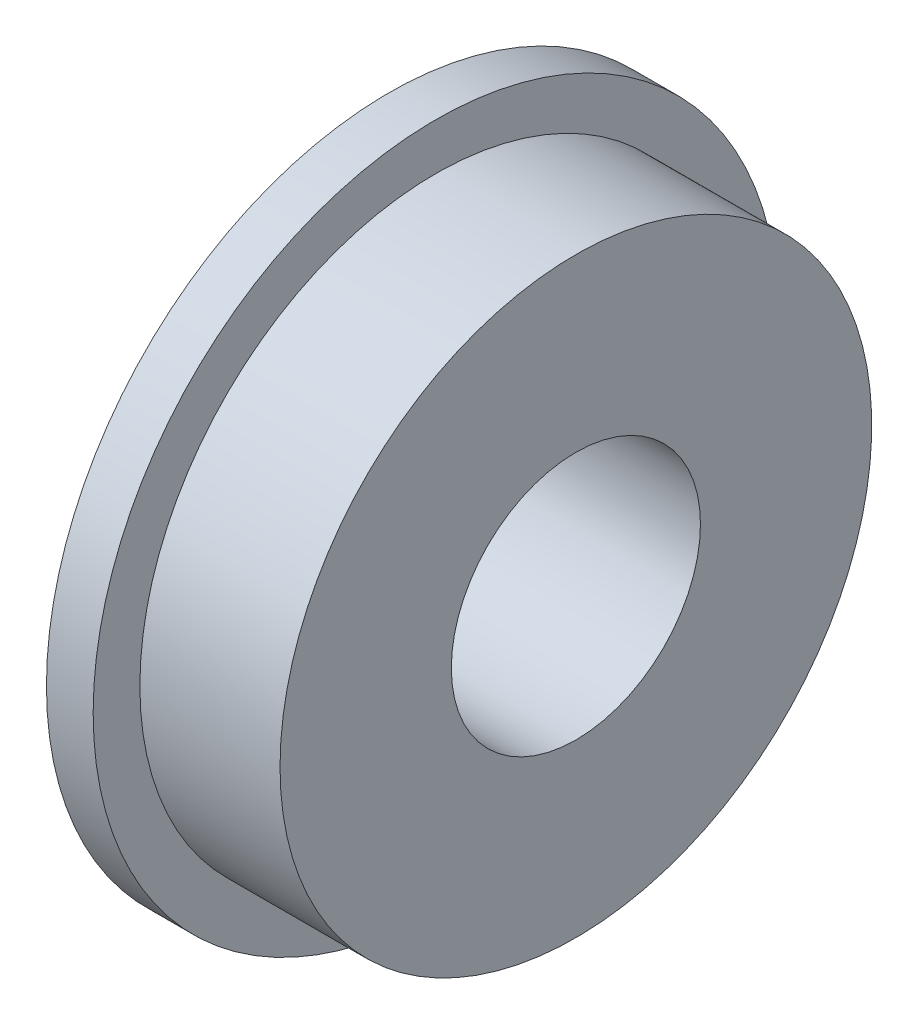
ISO-10303-21;
HEADER;
FILE_DESCRIPTION(('STEP AP214'),'2;1');
FILE_NAME('part.step','',(''),(''),'','','');
FILE_SCHEMA(('AUTOMOTIVE_DESIGN { 1 0 10303 214 1 1 1 1 }'));
ENDSEC;
DATA;
#1=APPLICATION_CONTEXT('core data for automotive mechanical design processes');
#2=APPLICATION_PROTOCOL_DEFINITION('international standard','automotive_design',2000,#1);
#3=PRODUCT_CONTEXT('',#1,'mechanical');
#4=PRODUCT('Part','Part','',(#3));
#5=PRODUCT_RELATED_PRODUCT_CATEGORY('part','',(#4));
#6=PRODUCT_DEFINITION_FORMATION('','',#4);
#7=PRODUCT_DEFINITION_CONTEXT('part definition',#1,'design');
#8=PRODUCT_DEFINITION('design','',#6,#7);
#9=PRODUCT_DEFINITION_SHAPE('','',#8);
#10=(LENGTH_UNIT() NAMED_UNIT(*) SI_UNIT(.MILLI.,.METRE.));
#11=(NAMED_UNIT(*) PLANE_ANGLE_UNIT() SI_UNIT($,.RADIAN.));
#12=(NAMED_UNIT(*) SI_UNIT($,.STERADIAN.) SOLID_ANGLE_UNIT());
#13=UNCERTAINTY_MEASURE_WITH_UNIT(LENGTH_MEASURE(1.E-05),#10,'distance_accuracy_value','');
#14=(GEOMETRIC_REPRESENTATION_CONTEXT(3) GLOBAL_UNCERTAINTY_ASSIGNED_CONTEXT((#13)) GLOBAL_UNIT_ASSIGNED_CONTEXT((#10,
#11,#12)) REPRESENTATION_CONTEXT('',''));
#15=CARTESIAN_POINT('',(0.,0.,0.));
#16=DIRECTION('',(0.,0.,1.));
#17=DIRECTION('',(1.,0.,0.));
#18=AXIS2_PLACEMENT_3D('',#15,#16,#17);
#19=CARTESIAN_POINT('',(1.5000000000001,10.9999999999995,0.));
#20=DIRECTION('',(1.,0.,0.));
#21=DIRECTION('',(0.,0.,-1.));
#22=AXIS2_PLACEMENT_3D('',#19,#20,#21);
#23=PLANE('',#22);
#24=CARTESIAN_POINT('',(1.5000000000001,3.1028875949998E-13,0.));
#25=DIRECTION('',(-1.,0.,0.));
#26=DIRECTION('',(0.,0.,1.));
#27=AXIS2_PLACEMENT_3D('',#24,#25,#26);
#28=CIRCLE('',#27,9.5000000000001);
#29=CARTESIAN_POINT('',(1.5000000000001,3.1028875949998E-13,9.5000000000001));
#30=VERTEX_POINT('',#29);
#31=EDGE_CURVE('E52',#30,#30,#28,.T.);
#32=ORIENTED_EDGE('',*,*,#31,.T.);
#33=EDGE_LOOP('',(#32));
#34=FACE_BOUND('',#33,.T.);
#35=CARTESIAN_POINT('',(1.5000000000001,3.1028875949998E-13,0.));
#36=DIRECTION('',(-1.,0.,0.));
#37=DIRECTION('',(0.,0.,1.));
#38=AXIS2_PLACEMENT_3D('',#35,#36,#37);
#39=CIRCLE('',#38,10.9999999999992);
#40=CARTESIAN_POINT('',(1.5000000000001,3.1028875949998E-13,10.9999999999992));
#41=VERTEX_POINT('',#40);
#42=EDGE_CURVE('E10',#41,#41,#39,.T.);
#43=ORIENTED_EDGE('',*,*,#42,.F.);
#44=EDGE_LOOP('',(#43));
#45=FACE_BOUND('',#44,.T.);
#46=ADVANCED_FACE('F30',(#34,#45),#23,.T.);
#47=CARTESIAN_POINT('',(5.99999999999886,3.1028875949998E-13,0.));
#48=DIRECTION('',(-1.,0.,0.));
#49=DIRECTION('',(0.,0.,1.));
#50=AXIS2_PLACEMENT_3D('',#47,#48,#49);
#51=CYLINDRICAL_SURFACE('',#50,10.9999999999992);
#52=ORIENTED_EDGE('',*,*,#42,.T.);
#53=EDGE_LOOP('',(#52));
#54=FACE_BOUND('',#53,.T.);
#55=CARTESIAN_POINT('',(0.,3.1028875949998E-13,0.));
#56=DIRECTION('',(-1.,0.,0.));
#57=DIRECTION('',(0.,0.,1.));
#58=AXIS2_PLACEMENT_3D('',#55,#56,#57);
#59=CIRCLE('',#58,10.9999999999992);
#60=CARTESIAN_POINT('',(0.,3.1028875949998E-13,10.9999999999992));
#61=VERTEX_POINT('',#60);
#62=EDGE_CURVE('E36',#61,#61,#59,.T.);
#63=ORIENTED_EDGE('',*,*,#62,.F.);
#64=EDGE_LOOP('',(#63));
#65=FACE_BOUND('',#64,.T.);
#66=ADVANCED_FACE('F70',(#54,#65),#51,.T.);
#67=CARTESIAN_POINT('',(0.,3.99999999999955,0.));
#68=DIRECTION('',(-1.,0.,0.));
#69=DIRECTION('',(0.,0.,1.));
#70=AXIS2_PLACEMENT_3D('',#67,#68,#69);
#71=PLANE('',#70);
#72=ORIENTED_EDGE('',*,*,#62,.T.);
#73=EDGE_LOOP('',(#72));
#74=FACE_BOUND('',#73,.T.);
#75=CARTESIAN_POINT('',(0.,3.1028875949998E-13,0.));
#76=DIRECTION('',(-1.,0.,0.));
#77=DIRECTION('',(0.,0.,1.));
#78=AXIS2_PLACEMENT_3D('',#75,#76,#77);
#79=CIRCLE('',#78,3.99999999999924);
#80=CARTESIAN_POINT('',(0.,3.1028875949998E-13,3.99999999999924));
#81=VERTEX_POINT('',#80);
#82=EDGE_CURVE('E40',#81,#81,#79,.T.);
#83=ORIENTED_EDGE('',*,*,#82,.F.);
#84=EDGE_LOOP('',(#83));
#85=FACE_BOUND('',#84,.T.);
#86=ADVANCED_FACE('F74',(#74,#85),#71,.T.);
#87=CARTESIAN_POINT('',(5.99999999999886,3.1028875949998E-13,0.));
#88=DIRECTION('',(-1.,0.,0.));
#89=DIRECTION('',(0.,0.,1.));
#90=AXIS2_PLACEMENT_3D('',#87,#88,#89);
#91=CYLINDRICAL_SURFACE('',#90,3.99999999999924);
#92=ORIENTED_EDGE('',*,*,#82,.T.);
#93=EDGE_LOOP('',(#92));
#94=FACE_BOUND('',#93,.T.);
#95=CARTESIAN_POINT('',(5.99999999999886,3.1028875949998E-13,0.));
#96=DIRECTION('',(-1.,0.,0.));
#97=DIRECTION('',(0.,0.,1.));
#98=AXIS2_PLACEMENT_3D('',#95,#96,#97);
#99=CIRCLE('',#98,3.99999999999924);
#100=CARTESIAN_POINT('',(5.99999999999886,3.1028875949998E-13,3.99999999999924));
#101=VERTEX_POINT('',#100);
#102=EDGE_CURVE('E44',#101,#101,#99,.T.);
#103=ORIENTED_EDGE('',*,*,#102,.F.);
#104=EDGE_LOOP('',(#103));
#105=FACE_BOUND('',#104,.T.);
#106=ADVANCED_FACE('F66',(#94,#105),#91,.F.);
#107=CARTESIAN_POINT('',(5.99999999999886,9.50000000000041,0.));
#108=DIRECTION('',(1.,0.,0.));
#109=DIRECTION('',(0.,0.,-1.));
#110=AXIS2_PLACEMENT_3D('',#107,#108,#109);
#111=PLANE('',#110);
#112=ORIENTED_EDGE('',*,*,#102,.T.);
#113=EDGE_LOOP('',(#112));
#114=FACE_BOUND('',#113,.T.);
#115=CARTESIAN_POINT('',(5.99999999999886,3.1028875949998E-13,0.));
#116=DIRECTION('',(-1.,0.,0.));
#117=DIRECTION('',(0.,0.,1.));
#118=AXIS2_PLACEMENT_3D('',#115,#116,#117);
#119=CIRCLE('',#118,9.5000000000001);
#120=CARTESIAN_POINT('',(5.99999999999886,3.1028875949998E-13,9.5000000000001));
#121=VERTEX_POINT('',#120);
#122=EDGE_CURVE('E49',#121,#121,#119,.T.);
#123=ORIENTED_EDGE('',*,*,#122,.F.);
#124=EDGE_LOOP('',(#123));
#125=FACE_BOUND('',#124,.T.);
#126=ADVANCED_FACE('F60',(#114,#125),#111,.T.);
#127=CARTESIAN_POINT('',(5.99999999999886,3.1028875949998E-13,0.));
#128=DIRECTION('',(-1.,0.,0.));
#129=DIRECTION('',(0.,0.,1.));
#130=AXIS2_PLACEMENT_3D('',#127,#128,#129);
#131=CYLINDRICAL_SURFACE('',#130,9.5000000000001);
#132=ORIENTED_EDGE('',*,*,#122,.T.);
#133=EDGE_LOOP('',(#132));
#134=FACE_BOUND('',#133,.T.);
#135=ORIENTED_EDGE('',*,*,#31,.F.);
#136=EDGE_LOOP('',(#135));
#137=FACE_BOUND('',#136,.T.);
#138=ADVANCED_FACE('F58',(#134,#137),#131,.T.);
#139=CLOSED_SHELL('',(#46,#66,#86,#106,#126,#138));
#140=MANIFOLD_SOLID_BREP('B2',#139);
#141=ADVANCED_BREP_SHAPE_REPRESENTATION('',(#18,#140),#14);
#142=SHAPE_DEFINITION_REPRESENTATION(#9,#141);
ENDSEC;
END-ISO-10303-21;
